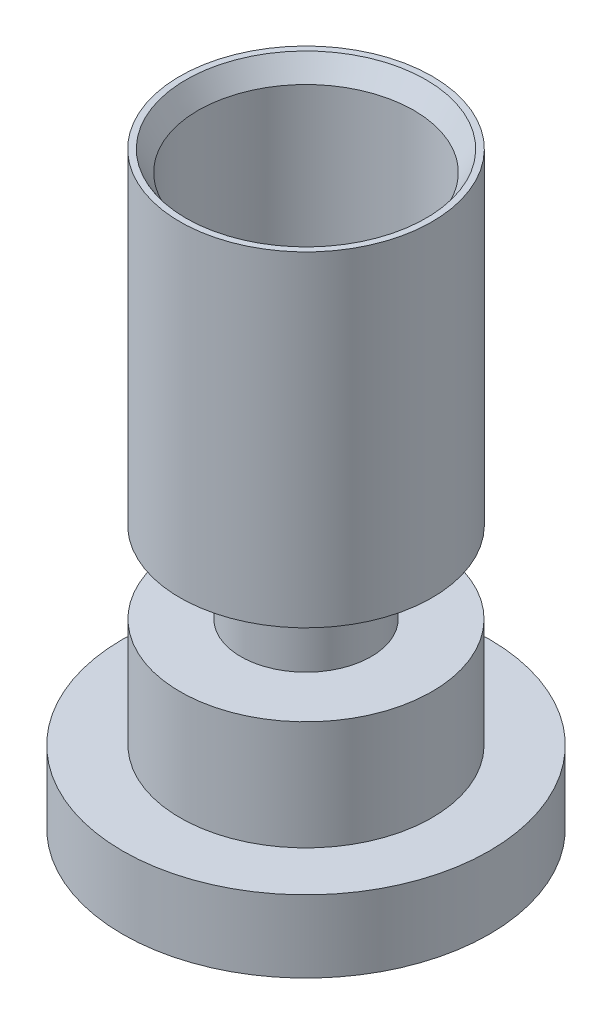
ISO-10303-21;
HEADER;
FILE_DESCRIPTION(('STEP AP214'),'2;1');
FILE_NAME('part.step','',(''),(''),'','','');
FILE_SCHEMA(('AUTOMOTIVE_DESIGN { 1 0 10303 214 1 1 1 1 }'));
ENDSEC;
DATA;
#1=APPLICATION_CONTEXT('core data for automotive mechanical design processes');
#2=APPLICATION_PROTOCOL_DEFINITION('international standard','automotive_design',2000,#1);
#3=PRODUCT_CONTEXT('',#1,'mechanical');
#4=PRODUCT('Part','Part','',(#3));
#5=PRODUCT_RELATED_PRODUCT_CATEGORY('part','',(#4));
#6=PRODUCT_DEFINITION_FORMATION('','',#4);
#7=PRODUCT_DEFINITION_CONTEXT('part definition',#1,'design');
#8=PRODUCT_DEFINITION('design','',#6,#7);
#9=PRODUCT_DEFINITION_SHAPE('','',#8);
#10=(LENGTH_UNIT() NAMED_UNIT(*) SI_UNIT(.MILLI.,.METRE.));
#11=(NAMED_UNIT(*) PLANE_ANGLE_UNIT() SI_UNIT($,.RADIAN.));
#12=(NAMED_UNIT(*) SI_UNIT($,.STERADIAN.) SOLID_ANGLE_UNIT());
#13=UNCERTAINTY_MEASURE_WITH_UNIT(LENGTH_MEASURE(1.E-05),#10,'distance_accuracy_value','');
#14=(GEOMETRIC_REPRESENTATION_CONTEXT(3) GLOBAL_UNCERTAINTY_ASSIGNED_CONTEXT((#13)) GLOBAL_UNIT_ASSIGNED_CONTEXT((#10,
#11,#12)) REPRESENTATION_CONTEXT('',''));
#15=CARTESIAN_POINT('',(0.,0.,0.));
#16=DIRECTION('',(0.,0.,1.));
#17=DIRECTION('',(1.,0.,0.));
#18=AXIS2_PLACEMENT_3D('',#15,#16,#17);
#19=CARTESIAN_POINT('',(4.5,0.,0.));
#20=DIRECTION('',(0.,-1.,0.));
#21=DIRECTION('',(0.,0.,-1.));
#22=AXIS2_PLACEMENT_3D('',#19,#20,#21);
#23=PLANE('',#22);
#24=CARTESIAN_POINT('',(0.,0.,0.));
#25=DIRECTION('',(0.,-1.,0.));
#26=DIRECTION('',(0.,0.,-1.));
#27=AXIS2_PLACEMENT_3D('',#24,#25,#26);
#28=CIRCLE('',#27,4.5);
#29=CARTESIAN_POINT('',(0.,0.,-4.5));
#30=VERTEX_POINT('',#29);
#31=EDGE_CURVE('E97',#30,#30,#28,.T.);
#32=ORIENTED_EDGE('',*,*,#31,.T.);
#33=EDGE_LOOP('',(#32));
#34=FACE_BOUND('',#33,.T.);
#35=CARTESIAN_POINT('',(0.,0.,0.));
#36=DIRECTION('',(0.,-1.,0.));
#37=DIRECTION('',(0.,0.,-1.));
#38=AXIS2_PLACEMENT_3D('',#35,#36,#37);
#39=CIRCLE('',#38,3.75);
#40=CARTESIAN_POINT('',(0.,0.,-3.75));
#41=VERTEX_POINT('',#40);
#42=EDGE_CURVE('E58',#41,#41,#39,.T.);
#43=ORIENTED_EDGE('',*,*,#42,.F.);
#44=EDGE_LOOP('',(#43));
#45=FACE_BOUND('',#44,.T.);
#46=ADVANCED_FACE('F37',(#34,#45),#23,.T.);
#47=CARTESIAN_POINT('',(0.,0.,0.));
#48=DIRECTION('',(0.,-1.,0.));
#49=DIRECTION('',(0.,0.,-1.));
#50=AXIS2_PLACEMENT_3D('',#47,#48,#49);
#51=CYLINDRICAL_SURFACE('',#50,3.75);
#52=ORIENTED_EDGE('',*,*,#42,.T.);
#53=EDGE_LOOP('',(#52));
#54=FACE_BOUND('',#53,.T.);
#55=CARTESIAN_POINT('',(0.,1.16,0.));
#56=DIRECTION('',(0.,-1.,0.));
#57=DIRECTION('',(0.,0.,-1.));
#58=AXIS2_PLACEMENT_3D('',#55,#56,#57);
#59=CIRCLE('',#58,3.75);
#60=CARTESIAN_POINT('',(0.,1.16,-3.75));
#61=VERTEX_POINT('',#60);
#62=EDGE_CURVE('E61',#61,#61,#59,.T.);
#63=ORIENTED_EDGE('',*,*,#62,.F.);
#64=EDGE_LOOP('',(#63));
#65=FACE_BOUND('',#64,.T.);
#66=ADVANCED_FACE('F118',(#54,#65),#51,.F.);
#67=CARTESIAN_POINT('',(3.75,1.16,0.));
#68=DIRECTION('',(0.,-1.,0.));
#69=DIRECTION('',(0.,0.,-1.));
#70=AXIS2_PLACEMENT_3D('',#67,#68,#69);
#71=PLANE('',#70);
#72=ORIENTED_EDGE('',*,*,#62,.T.);
#73=EDGE_LOOP('',(#72));
#74=FACE_BOUND('',#73,.T.);
#75=CARTESIAN_POINT('',(0.,1.16,0.));
#76=DIRECTION('',(0.,-1.,0.));
#77=DIRECTION('',(0.,0.,-1.));
#78=AXIS2_PLACEMENT_3D('',#75,#76,#77);
#79=CIRCLE('',#78,1.6);
#80=CARTESIAN_POINT('',(0.,1.16,-1.6));
#81=VERTEX_POINT('',#80);
#82=EDGE_CURVE('E64',#81,#81,#79,.T.);
#83=ORIENTED_EDGE('',*,*,#82,.F.);
#84=EDGE_LOOP('',(#83));
#85=FACE_BOUND('',#84,.T.);
#86=ADVANCED_FACE('F123',(#74,#85),#71,.T.);
#87=CARTESIAN_POINT('',(0.,0.,0.));
#88=DIRECTION('',(0.,-1.,0.));
#89=DIRECTION('',(0.,0.,-1.));
#90=AXIS2_PLACEMENT_3D('',#87,#88,#89);
#91=CYLINDRICAL_SURFACE('',#90,1.6);
#92=ORIENTED_EDGE('',*,*,#82,.T.);
#93=EDGE_LOOP('',(#92));
#94=FACE_BOUND('',#93,.T.);
#95=CARTESIAN_POINT('',(0.,3.45,0.));
#96=DIRECTION('',(0.,-1.,0.));
#97=DIRECTION('',(0.,0.,-1.));
#98=AXIS2_PLACEMENT_3D('',#95,#96,#97);
#99=CIRCLE('',#98,1.6);
#100=CARTESIAN_POINT('',(0.,3.45,-1.6));
#101=VERTEX_POINT('',#100);
#102=EDGE_CURVE('E67',#101,#101,#99,.T.);
#103=ORIENTED_EDGE('',*,*,#102,.F.);
#104=EDGE_LOOP('',(#103));
#105=FACE_BOUND('',#104,.T.);
#106=ADVANCED_FACE('F134',(#94,#105),#91,.F.);
#107=CARTESIAN_POINT('',(1.6,3.45,0.));
#108=DIRECTION('',(0.,-1.,0.));
#109=DIRECTION('',(0.,0.,-1.));
#110=AXIS2_PLACEMENT_3D('',#107,#108,#109);
#111=PLANE('',#110);
#112=ORIENTED_EDGE('',*,*,#102,.T.);
#113=EDGE_LOOP('',(#112));
#114=FACE_BOUND('',#113,.T.);
#115=CARTESIAN_POINT('',(0.,3.45,0.));
#116=DIRECTION('',(0.,-1.,0.));
#117=DIRECTION('',(0.,0.,-1.));
#118=AXIS2_PLACEMENT_3D('',#115,#116,#117);
#119=CIRCLE('',#118,0.625);
#120=CARTESIAN_POINT('',(0.,3.45,-0.625));
#121=VERTEX_POINT('',#120);
#122=EDGE_CURVE('E70',#121,#121,#119,.T.);
#123=ORIENTED_EDGE('',*,*,#122,.F.);
#124=EDGE_LOOP('',(#123));
#125=FACE_BOUND('',#124,.T.);
#126=ADVANCED_FACE('F138',(#114,#125),#111,.T.);
#127=CARTESIAN_POINT('',(0.,0.,0.));
#128=DIRECTION('',(0.,-1.,0.));
#129=DIRECTION('',(0.,0.,-1.));
#130=AXIS2_PLACEMENT_3D('',#127,#128,#129);
#131=CYLINDRICAL_SURFACE('',#130,0.625);
#132=ORIENTED_EDGE('',*,*,#122,.T.);
#133=EDGE_LOOP('',(#132));
#134=FACE_BOUND('',#133,.T.);
#135=CARTESIAN_POINT('',(0.,6.44,0.));
#136=DIRECTION('',(0.,-1.,0.));
#137=DIRECTION('',(0.,0.,-1.));
#138=AXIS2_PLACEMENT_3D('',#135,#136,#137);
#139=CIRCLE('',#138,0.625);
#140=CARTESIAN_POINT('',(0.,6.44,-0.625));
#141=VERTEX_POINT('',#140);
#142=EDGE_CURVE('E73',#141,#141,#139,.T.);
#143=ORIENTED_EDGE('',*,*,#142,.F.);
#144=EDGE_LOOP('',(#143));
#145=FACE_BOUND('',#144,.T.);
#146=ADVANCED_FACE('F142',(#134,#145),#131,.F.);
#147=CARTESIAN_POINT('',(0.625,6.44,0.));
#148=DIRECTION('',(0.,1.,0.));
#149=DIRECTION('',(0.,0.,1.));
#150=AXIS2_PLACEMENT_3D('',#147,#148,#149);
#151=PLANE('',#150);
#152=ORIENTED_EDGE('',*,*,#142,.T.);
#153=EDGE_LOOP('',(#152));
#154=FACE_BOUND('',#153,.T.);
#155=CARTESIAN_POINT('',(0.,6.44,0.));
#156=DIRECTION('',(0.,-1.,0.));
#157=DIRECTION('',(0.,0.,-1.));
#158=AXIS2_PLACEMENT_3D('',#155,#156,#157);
#159=CIRCLE('',#158,2.645);
#160=CARTESIAN_POINT('',(0.,6.44,-2.645));
#161=VERTEX_POINT('',#160);
#162=EDGE_CURVE('E76',#161,#161,#159,.T.);
#163=ORIENTED_EDGE('',*,*,#162,.F.);
#164=EDGE_LOOP('',(#163));
#165=FACE_BOUND('',#164,.T.);
#166=ADVANCED_FACE('F146',(#154,#165),#151,.T.);
#167=CARTESIAN_POINT('',(0.,0.,0.));
#168=DIRECTION('',(0.,-1.,0.));
#169=DIRECTION('',(0.,0.,-1.));
#170=AXIS2_PLACEMENT_3D('',#167,#168,#169);
#171=CYLINDRICAL_SURFACE('',#170,2.645);
#172=CARTESIAN_POINT('',(0.,13.94,0.));
#173=DIRECTION('',(0.,1.,0.));
#174=DIRECTION('',(0.,0.,1.));
#175=AXIS2_PLACEMENT_3D('',#172,#173,#174);
#176=CIRCLE('',#175,2.645);
#177=CARTESIAN_POINT('',(0.,13.94,2.645));
#178=VERTEX_POINT('',#177);
#179=EDGE_CURVE('E49',#178,#178,#176,.T.);
#180=ORIENTED_EDGE('',*,*,#179,.T.);
#181=EDGE_LOOP('',(#180));
#182=FACE_BOUND('',#181,.T.);
#183=ORIENTED_EDGE('',*,*,#162,.T.);
#184=EDGE_LOOP('',(#183));
#185=FACE_BOUND('',#184,.T.);
#186=ADVANCED_FACE('F150',(#182,#185),#171,.F.);
#187=CARTESIAN_POINT('',(2.645,14.44,0.));
#188=DIRECTION('',(0.,1.,0.));
#189=DIRECTION('',(0.,0.,1.));
#190=AXIS2_PLACEMENT_3D('',#187,#188,#189);
#191=PLANE('',#190);
#192=CARTESIAN_POINT('',(0.,14.44,0.));
#193=DIRECTION('',(0.,1.,0.));
#194=DIRECTION('',(0.,0.,1.));
#195=AXIS2_PLACEMENT_3D('',#192,#193,#194);
#196=CIRCLE('',#195,2.945);
#197=CARTESIAN_POINT('',(0.,14.44,2.945));
#198=VERTEX_POINT('',#197);
#199=EDGE_CURVE('E53',#198,#198,#196,.F.);
#200=ORIENTED_EDGE('',*,*,#199,.T.);
#201=EDGE_LOOP('',(#200));
#202=FACE_BOUND('',#201,.T.);
#203=CARTESIAN_POINT('',(0.,14.44,0.));
#204=DIRECTION('',(0.,-1.,0.));
#205=DIRECTION('',(0.,0.,-1.));
#206=AXIS2_PLACEMENT_3D('',#203,#204,#205);
#207=CIRCLE('',#206,3.095);
#208=CARTESIAN_POINT('',(0.,14.44,-3.095));
#209=VERTEX_POINT('',#208);
#210=EDGE_CURVE('E79',#209,#209,#207,.T.);
#211=ORIENTED_EDGE('',*,*,#210,.F.);
#212=EDGE_LOOP('',(#211));
#213=FACE_BOUND('',#212,.T.);
#214=ADVANCED_FACE('F154',(#202,#213),#191,.T.);
#215=CARTESIAN_POINT('',(0.,0.,0.));
#216=DIRECTION('',(0.,-1.,0.));
#217=DIRECTION('',(0.,0.,-1.));
#218=AXIS2_PLACEMENT_3D('',#215,#216,#217);
#219=CYLINDRICAL_SURFACE('',#218,3.095);
#220=CARTESIAN_POINT('',(0.,6.45000000000001,0.));
#221=DIRECTION('',(0.,-1.,0.));
#222=DIRECTION('',(0.,0.,-1.));
#223=AXIS2_PLACEMENT_3D('',#220,#221,#222);
#224=CIRCLE('',#223,3.095);
#225=CARTESIAN_POINT('',(0.,6.45000000000001,-3.095));
#226=VERTEX_POINT('',#225);
#227=EDGE_CURVE('E10',#226,#226,#224,.F.);
#228=ORIENTED_EDGE('',*,*,#227,.T.);
#229=EDGE_LOOP('',(#228));
#230=FACE_BOUND('',#229,.T.);
#231=ORIENTED_EDGE('',*,*,#210,.T.);
#232=EDGE_LOOP('',(#231));
#233=FACE_BOUND('',#232,.T.);
#234=ADVANCED_FACE('F158',(#230,#233),#219,.T.);
#235=CARTESIAN_POINT('',(3.095,5.95,0.));
#236=DIRECTION('',(0.,-1.,0.));
#237=DIRECTION('',(0.,0.,-1.));
#238=AXIS2_PLACEMENT_3D('',#235,#236,#237);
#239=PLANE('',#238);
#240=CARTESIAN_POINT('',(0.,5.95,0.));
#241=DIRECTION('',(0.,-1.,0.));
#242=DIRECTION('',(0.,0.,-1.));
#243=AXIS2_PLACEMENT_3D('',#240,#241,#242);
#244=CIRCLE('',#243,2.34499999999999);
#245=CARTESIAN_POINT('',(0.,5.95,-2.34499999999999));
#246=VERTEX_POINT('',#245);
#247=EDGE_CURVE('E45',#246,#246,#244,.T.);
#248=ORIENTED_EDGE('',*,*,#247,.T.);
#249=EDGE_LOOP('',(#248));
#250=FACE_BOUND('',#249,.T.);
#251=CARTESIAN_POINT('',(0.,5.95,0.));
#252=DIRECTION('',(0.,-1.,0.));
#253=DIRECTION('',(0.,0.,-1.));
#254=AXIS2_PLACEMENT_3D('',#251,#252,#253);
#255=CIRCLE('',#254,1.6);
#256=CARTESIAN_POINT('',(0.,5.95,-1.6));
#257=VERTEX_POINT('',#256);
#258=EDGE_CURVE('E82',#257,#257,#255,.T.);
#259=ORIENTED_EDGE('',*,*,#258,.F.);
#260=EDGE_LOOP('',(#259));
#261=FACE_BOUND('',#260,.T.);
#262=ADVANCED_FACE('F162',(#250,#261),#239,.T.);
#263=CARTESIAN_POINT('',(0.,0.,0.));
#264=DIRECTION('',(0.,-1.,0.));
#265=DIRECTION('',(0.,0.,-1.));
#266=AXIS2_PLACEMENT_3D('',#263,#264,#265);
#267=CYLINDRICAL_SURFACE('',#266,1.6);
#268=ORIENTED_EDGE('',*,*,#258,.T.);
#269=EDGE_LOOP('',(#268));
#270=FACE_BOUND('',#269,.T.);
#271=CARTESIAN_POINT('',(0.,4.45,0.));
#272=DIRECTION('',(0.,-1.,0.));
#273=DIRECTION('',(0.,0.,-1.));
#274=AXIS2_PLACEMENT_3D('',#271,#272,#273);
#275=CIRCLE('',#274,1.6);
#276=CARTESIAN_POINT('',(0.,4.45,-1.6));
#277=VERTEX_POINT('',#276);
#278=EDGE_CURVE('E85',#277,#277,#275,.T.);
#279=ORIENTED_EDGE('',*,*,#278,.F.);
#280=EDGE_LOOP('',(#279));
#281=FACE_BOUND('',#280,.T.);
#282=ADVANCED_FACE('F165',(#270,#281),#267,.T.);
#283=CARTESIAN_POINT('',(1.6,4.45,0.));
#284=DIRECTION('',(0.,1.,0.));
#285=DIRECTION('',(0.,0.,1.));
#286=AXIS2_PLACEMENT_3D('',#283,#284,#285);
#287=PLANE('',#286);
#288=ORIENTED_EDGE('',*,*,#278,.T.);
#289=EDGE_LOOP('',(#288));
#290=FACE_BOUND('',#289,.T.);
#291=CARTESIAN_POINT('',(0.,4.45,0.));
#292=DIRECTION('',(0.,-1.,0.));
#293=DIRECTION('',(0.,0.,-1.));
#294=AXIS2_PLACEMENT_3D('',#291,#292,#293);
#295=CIRCLE('',#294,3.09);
#296=CARTESIAN_POINT('',(0.,4.45,-3.09));
#297=VERTEX_POINT('',#296);
#298=EDGE_CURVE('E88',#297,#297,#295,.T.);
#299=ORIENTED_EDGE('',*,*,#298,.F.);
#300=EDGE_LOOP('',(#299));
#301=FACE_BOUND('',#300,.T.);
#302=ADVANCED_FACE('F168',(#290,#301),#287,.T.);
#303=CARTESIAN_POINT('',(0.,0.,0.));
#304=DIRECTION('',(0.,-1.,0.));
#305=DIRECTION('',(0.,0.,-1.));
#306=AXIS2_PLACEMENT_3D('',#303,#304,#305);
#307=CYLINDRICAL_SURFACE('',#306,3.09);
#308=ORIENTED_EDGE('',*,*,#298,.T.);
#309=EDGE_LOOP('',(#308));
#310=FACE_BOUND('',#309,.T.);
#311=CARTESIAN_POINT('',(0.,1.77,0.));
#312=DIRECTION('',(0.,-1.,0.));
#313=DIRECTION('',(0.,0.,-1.));
#314=AXIS2_PLACEMENT_3D('',#311,#312,#313);
#315=CIRCLE('',#314,3.09);
#316=CARTESIAN_POINT('',(0.,1.77,-3.09));
#317=VERTEX_POINT('',#316);
#318=EDGE_CURVE('E91',#317,#317,#315,.T.);
#319=ORIENTED_EDGE('',*,*,#318,.F.);
#320=EDGE_LOOP('',(#319));
#321=FACE_BOUND('',#320,.T.);
#322=ADVANCED_FACE('F114',(#310,#321),#307,.T.);
#323=CARTESIAN_POINT('',(3.09,1.77,0.));
#324=DIRECTION('',(0.,1.,0.));
#325=DIRECTION('',(0.,0.,1.));
#326=AXIS2_PLACEMENT_3D('',#323,#324,#325);
#327=PLANE('',#326);
#328=ORIENTED_EDGE('',*,*,#318,.T.);
#329=EDGE_LOOP('',(#328));
#330=FACE_BOUND('',#329,.T.);
#331=CARTESIAN_POINT('',(0.,1.77,0.));
#332=DIRECTION('',(0.,-1.,0.));
#333=DIRECTION('',(0.,0.,-1.));
#334=AXIS2_PLACEMENT_3D('',#331,#332,#333);
#335=CIRCLE('',#334,4.5);
#336=CARTESIAN_POINT('',(0.,1.77,-4.5));
#337=VERTEX_POINT('',#336);
#338=EDGE_CURVE('E94',#337,#337,#335,.T.);
#339=ORIENTED_EDGE('',*,*,#338,.F.);
#340=EDGE_LOOP('',(#339));
#341=FACE_BOUND('',#340,.T.);
#342=ADVANCED_FACE('F106',(#330,#341),#327,.T.);
#343=CARTESIAN_POINT('',(0.,0.,0.));
#344=DIRECTION('',(0.,-1.,0.));
#345=DIRECTION('',(0.,0.,-1.));
#346=AXIS2_PLACEMENT_3D('',#343,#344,#345);
#347=CYLINDRICAL_SURFACE('',#346,4.5);
#348=ORIENTED_EDGE('',*,*,#338,.T.);
#349=EDGE_LOOP('',(#348));
#350=FACE_BOUND('',#349,.T.);
#351=ORIENTED_EDGE('',*,*,#31,.F.);
#352=EDGE_LOOP('',(#351));
#353=FACE_BOUND('',#352,.T.);
#354=ADVANCED_FACE('F103',(#350,#353),#347,.T.);
#355=CARTESIAN_POINT('',(0.,14.44,0.));
#356=DIRECTION('',(0.,1.,0.));
#357=DIRECTION('',(0.,0.,1.));
#358=AXIS2_PLACEMENT_3D('',#355,#356,#357);
#359=CONICAL_SURFACE('',#358,2.945,0.540419500270581);
#360=ORIENTED_EDGE('',*,*,#179,.F.);
#361=EDGE_LOOP('',(#360));
#362=FACE_BOUND('',#361,.T.);
#363=ORIENTED_EDGE('',*,*,#199,.F.);
#364=EDGE_LOOP('',(#363));
#365=FACE_BOUND('',#364,.T.);
#366=ADVANCED_FACE('F105',(#362,#365),#359,.F.);
#367=CARTESIAN_POINT('',(0.,5.95,0.));
#368=DIRECTION('',(0.,1.,0.));
#369=DIRECTION('',(0.,0.,1.));
#370=AXIS2_PLACEMENT_3D('',#367,#368,#369);
#371=CONICAL_SURFACE('',#370,2.34499999999999,0.98279372324733);
#372=ORIENTED_EDGE('',*,*,#227,.F.);
#373=EDGE_LOOP('',(#372));
#374=FACE_BOUND('',#373,.T.);
#375=ORIENTED_EDGE('',*,*,#247,.F.);
#376=EDGE_LOOP('',(#375));
#377=FACE_BOUND('',#376,.T.);
#378=ADVANCED_FACE('F40',(#374,#377),#371,.T.);
#379=CLOSED_SHELL('',(#46,#66,#86,#106,#126,#146,#166,#186,#214,#234,#262,#282,#302,#322,#342,
#354,#366,#378));
#380=MANIFOLD_SOLID_BREP('B2',#379);
#381=ADVANCED_BREP_SHAPE_REPRESENTATION('',(#18,#380),#14);
#382=SHAPE_DEFINITION_REPRESENTATION(#9,#381);
ENDSEC;
END-ISO-10303-21;
